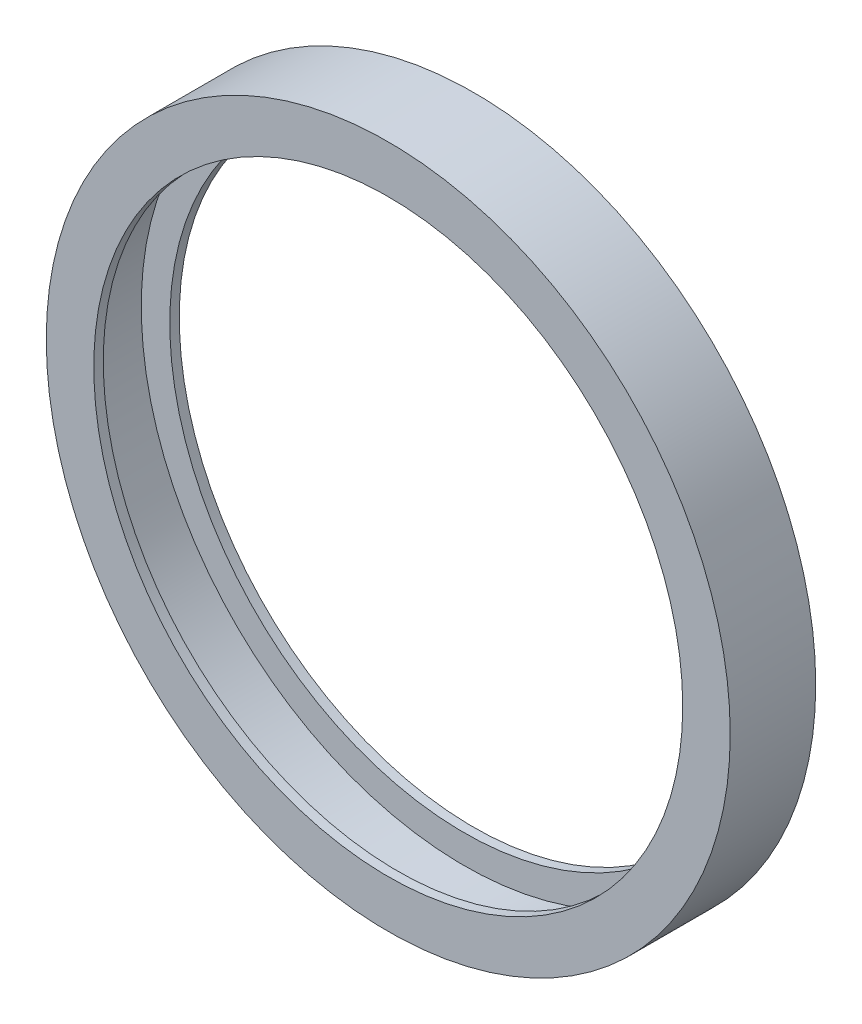
ISO-10303-21;
HEADER;
FILE_DESCRIPTION(('STEP AP214'),'2;1');
FILE_NAME('part.step','',(''),(''),'','','');
FILE_SCHEMA(('AUTOMOTIVE_DESIGN { 1 0 10303 214 1 1 1 1 }'));
ENDSEC;
DATA;
#1=APPLICATION_CONTEXT('core data for automotive mechanical design processes');
#2=APPLICATION_PROTOCOL_DEFINITION('international standard','automotive_design',2000,#1);
#3=PRODUCT_CONTEXT('',#1,'mechanical');
#4=PRODUCT('Part','Part','',(#3));
#5=PRODUCT_RELATED_PRODUCT_CATEGORY('part','',(#4));
#6=PRODUCT_DEFINITION_FORMATION('','',#4);
#7=PRODUCT_DEFINITION_CONTEXT('part definition',#1,'design');
#8=PRODUCT_DEFINITION('design','',#6,#7);
#9=PRODUCT_DEFINITION_SHAPE('','',#8);
#10=(LENGTH_UNIT() NAMED_UNIT(*) SI_UNIT(.MILLI.,.METRE.));
#11=(NAMED_UNIT(*) PLANE_ANGLE_UNIT() SI_UNIT($,.RADIAN.));
#12=(NAMED_UNIT(*) SI_UNIT($,.STERADIAN.) SOLID_ANGLE_UNIT());
#13=UNCERTAINTY_MEASURE_WITH_UNIT(LENGTH_MEASURE(1.E-05),#10,'distance_accuracy_value','');
#14=(GEOMETRIC_REPRESENTATION_CONTEXT(3) GLOBAL_UNCERTAINTY_ASSIGNED_CONTEXT((#13)) GLOBAL_UNIT_ASSIGNED_CONTEXT((#10,
#11,#12)) REPRESENTATION_CONTEXT('',''));
#15=CARTESIAN_POINT('',(0.,0.,0.));
#16=DIRECTION('',(0.,0.,1.));
#17=DIRECTION('',(1.,0.,0.));
#18=AXIS2_PLACEMENT_3D('',#15,#16,#17);
#19=CARTESIAN_POINT('',(0.,0.,1.));
#20=DIRECTION('',(0.,0.,1.));
#21=DIRECTION('',(1.,0.,0.));
#22=AXIS2_PLACEMENT_3D('',#19,#20,#21);
#23=PLANE('',#22);
#24=CARTESIAN_POINT('',(0.,0.,1.));
#25=DIRECTION('',(0.,0.,1.));
#26=DIRECTION('',(1.,0.,0.));
#27=AXIS2_PLACEMENT_3D('',#24,#25,#26);
#28=CIRCLE('',#27,31.);
#29=CARTESIAN_POINT('',(31.,0.,1.));
#30=VERTEX_POINT('',#29);
#31=EDGE_CURVE('E46',#30,#30,#28,.T.);
#32=ORIENTED_EDGE('',*,*,#31,.F.);
#33=EDGE_LOOP('',(#32));
#34=FACE_BOUND('',#33,.T.);
#35=CARTESIAN_POINT('',(0.,0.,1.));
#36=DIRECTION('',(0.,0.,1.));
#37=DIRECTION('',(1.,0.,0.));
#38=AXIS2_PLACEMENT_3D('',#35,#36,#37);
#39=CIRCLE('',#38,34.);
#40=CARTESIAN_POINT('',(34.,0.,1.));
#41=VERTEX_POINT('',#40);
#42=EDGE_CURVE('E10',#41,#41,#39,.F.);
#43=ORIENTED_EDGE('',*,*,#42,.F.);
#44=EDGE_LOOP('',(#43));
#45=FACE_BOUND('',#44,.T.);
#46=ADVANCED_FACE('F35',(#34,#45),#23,.T.);
#47=CARTESIAN_POINT('',(0.,0.,0.));
#48=DIRECTION('',(0.,0.,1.));
#49=DIRECTION('',(1.,0.,0.));
#50=AXIS2_PLACEMENT_3D('',#47,#48,#49);
#51=PLANE('',#50);
#52=CARTESIAN_POINT('',(0.,0.,0.));
#53=DIRECTION('',(0.,0.,1.));
#54=DIRECTION('',(1.,0.,0.));
#55=AXIS2_PLACEMENT_3D('',#52,#53,#54);
#56=CIRCLE('',#55,36.);
#57=CARTESIAN_POINT('',(36.,0.,0.));
#58=VERTEX_POINT('',#57);
#59=EDGE_CURVE('E42',#58,#58,#56,.T.);
#60=ORIENTED_EDGE('',*,*,#59,.F.);
#61=EDGE_LOOP('',(#60));
#62=FACE_BOUND('',#61,.T.);
#63=CARTESIAN_POINT('',(0.,0.,0.));
#64=DIRECTION('',(0.,0.,1.));
#65=DIRECTION('',(1.,0.,0.));
#66=AXIS2_PLACEMENT_3D('',#63,#64,#65);
#67=CIRCLE('',#66,31.);
#68=CARTESIAN_POINT('',(31.,0.,0.));
#69=VERTEX_POINT('',#68);
#70=EDGE_CURVE('E50',#69,#69,#67,.T.);
#71=ORIENTED_EDGE('',*,*,#70,.T.);
#72=EDGE_LOOP('',(#71));
#73=FACE_BOUND('',#72,.T.);
#74=ADVANCED_FACE('F85',(#62,#73),#51,.F.);
#75=CARTESIAN_POINT('',(0.,0.,1.));
#76=DIRECTION('',(0.,0.,-1.));
#77=DIRECTION('',(-1.,0.,0.));
#78=AXIS2_PLACEMENT_3D('',#75,#76,#77);
#79=CYLINDRICAL_SURFACE('',#78,36.);
#80=ORIENTED_EDGE('',*,*,#59,.T.);
#81=EDGE_LOOP('',(#80));
#82=FACE_BOUND('',#81,.T.);
#83=CARTESIAN_POINT('',(0.,0.,9.));
#84=DIRECTION('',(0.,0.,1.));
#85=DIRECTION('',(1.,0.,0.));
#86=AXIS2_PLACEMENT_3D('',#83,#84,#85);
#87=CIRCLE('',#86,36.);
#88=CARTESIAN_POINT('',(36.,0.,9.));
#89=VERTEX_POINT('',#88);
#90=EDGE_CURVE('E58',#89,#89,#87,.T.);
#91=ORIENTED_EDGE('',*,*,#90,.F.);
#92=EDGE_LOOP('',(#91));
#93=FACE_BOUND('',#92,.T.);
#94=ADVANCED_FACE('F37',(#82,#93),#79,.T.);
#95=CARTESIAN_POINT('',(0.,0.,1.));
#96=DIRECTION('',(0.,0.,-1.));
#97=DIRECTION('',(-1.,0.,0.));
#98=AXIS2_PLACEMENT_3D('',#95,#96,#97);
#99=CYLINDRICAL_SURFACE('',#98,31.);
#100=ORIENTED_EDGE('',*,*,#31,.T.);
#101=EDGE_LOOP('',(#100));
#102=FACE_BOUND('',#101,.T.);
#103=ORIENTED_EDGE('',*,*,#70,.F.);
#104=EDGE_LOOP('',(#103));
#105=FACE_BOUND('',#104,.T.);
#106=ADVANCED_FACE('F95',(#102,#105),#99,.F.);
#107=CARTESIAN_POINT('',(0.,0.,8.));
#108=DIRECTION('',(0.,0.,-1.));
#109=DIRECTION('',(-1.,0.,0.));
#110=AXIS2_PLACEMENT_3D('',#107,#108,#109);
#111=CYLINDRICAL_SURFACE('',#110,34.);
#112=CARTESIAN_POINT('',(0.,0.,8.));
#113=DIRECTION('',(0.,0.,1.));
#114=DIRECTION('',(1.,0.,0.));
#115=AXIS2_PLACEMENT_3D('',#112,#113,#114);
#116=CIRCLE('',#115,34.);
#117=CARTESIAN_POINT('',(34.,0.,8.));
#118=VERTEX_POINT('',#117);
#119=EDGE_CURVE('E54',#118,#118,#116,.T.);
#120=ORIENTED_EDGE('',*,*,#119,.T.);
#121=EDGE_LOOP('',(#120));
#122=FACE_BOUND('',#121,.T.);
#123=ORIENTED_EDGE('',*,*,#42,.T.);
#124=EDGE_LOOP('',(#123));
#125=FACE_BOUND('',#124,.T.);
#126=ADVANCED_FACE('F81',(#122,#125),#111,.F.);
#127=CARTESIAN_POINT('',(0.,0.,8.));
#128=DIRECTION('',(0.,0.,1.));
#129=DIRECTION('',(1.,0.,0.));
#130=AXIS2_PLACEMENT_3D('',#127,#128,#129);
#131=PLANE('',#130);
#132=CARTESIAN_POINT('',(0.,0.,8.));
#133=DIRECTION('',(0.,0.,1.));
#134=DIRECTION('',(1.,0.,0.));
#135=AXIS2_PLACEMENT_3D('',#132,#133,#134);
#136=CIRCLE('',#135,31.);
#137=CARTESIAN_POINT('',(31.,0.,8.));
#138=VERTEX_POINT('',#137);
#139=EDGE_CURVE('E62',#138,#138,#136,.T.);
#140=ORIENTED_EDGE('',*,*,#139,.T.);
#141=EDGE_LOOP('',(#140));
#142=FACE_BOUND('',#141,.T.);
#143=ORIENTED_EDGE('',*,*,#119,.F.);
#144=EDGE_LOOP('',(#143));
#145=FACE_BOUND('',#144,.T.);
#146=ADVANCED_FACE('F73',(#142,#145),#131,.F.);
#147=CARTESIAN_POINT('',(0.,0.,9.));
#148=DIRECTION('',(0.,0.,1.));
#149=DIRECTION('',(1.,0.,0.));
#150=AXIS2_PLACEMENT_3D('',#147,#148,#149);
#151=PLANE('',#150);
#152=ORIENTED_EDGE('',*,*,#90,.T.);
#153=EDGE_LOOP('',(#152));
#154=FACE_BOUND('',#153,.T.);
#155=CARTESIAN_POINT('',(0.,0.,9.));
#156=DIRECTION('',(0.,0.,1.));
#157=DIRECTION('',(1.,0.,0.));
#158=AXIS2_PLACEMENT_3D('',#155,#156,#157);
#159=CIRCLE('',#158,31.);
#160=CARTESIAN_POINT('',(31.,0.,9.));
#161=VERTEX_POINT('',#160);
#162=EDGE_CURVE('E61',#161,#161,#159,.T.);
#163=ORIENTED_EDGE('',*,*,#162,.F.);
#164=EDGE_LOOP('',(#163));
#165=FACE_BOUND('',#164,.T.);
#166=ADVANCED_FACE('F71',(#154,#165),#151,.T.);
#167=CARTESIAN_POINT('',(0.,0.,9.));
#168=DIRECTION('',(0.,0.,-1.));
#169=DIRECTION('',(-1.,0.,0.));
#170=AXIS2_PLACEMENT_3D('',#167,#168,#169);
#171=CYLINDRICAL_SURFACE('',#170,31.);
#172=ORIENTED_EDGE('',*,*,#162,.T.);
#173=EDGE_LOOP('',(#172));
#174=FACE_BOUND('',#173,.T.);
#175=ORIENTED_EDGE('',*,*,#139,.F.);
#176=EDGE_LOOP('',(#175));
#177=FACE_BOUND('',#176,.T.);
#178=ADVANCED_FACE('F68',(#174,#177),#171,.F.);
#179=CLOSED_SHELL('',(#46,#74,#94,#106,#126,#146,#166,#178));
#180=MANIFOLD_SOLID_BREP('B2',#179);
#181=ADVANCED_BREP_SHAPE_REPRESENTATION('',(#18,#180),#14);
#182=SHAPE_DEFINITION_REPRESENTATION(#9,#181);
ENDSEC;
END-ISO-10303-21;
